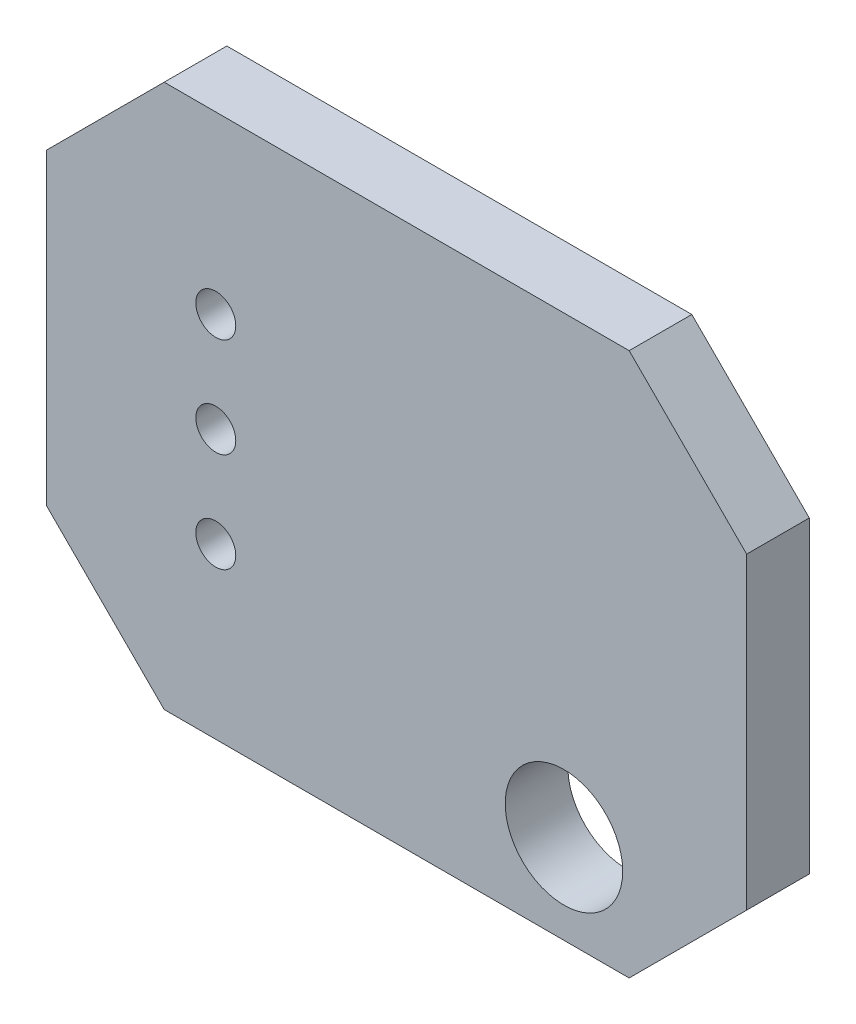
ISO-10303-21;
HEADER;
FILE_DESCRIPTION(('STEP AP214'),'2;1');
FILE_NAME('part.step','',(''),(''),'','','');
FILE_SCHEMA(('AUTOMOTIVE_DESIGN { 1 0 10303 214 1 1 1 1 }'));
ENDSEC;
DATA;
#1=APPLICATION_CONTEXT('core data for automotive mechanical design processes');
#2=APPLICATION_PROTOCOL_DEFINITION('international standard','automotive_design',2000,#1);
#3=PRODUCT_CONTEXT('',#1,'mechanical');
#4=PRODUCT('Part','Part','',(#3));
#5=PRODUCT_RELATED_PRODUCT_CATEGORY('part','',(#4));
#6=PRODUCT_DEFINITION_FORMATION('','',#4);
#7=PRODUCT_DEFINITION_CONTEXT('part definition',#1,'design');
#8=PRODUCT_DEFINITION('design','',#6,#7);
#9=PRODUCT_DEFINITION_SHAPE('','',#8);
#10=(LENGTH_UNIT() NAMED_UNIT(*) SI_UNIT(.MILLI.,.METRE.));
#11=(NAMED_UNIT(*) PLANE_ANGLE_UNIT() SI_UNIT($,.RADIAN.));
#12=(NAMED_UNIT(*) SI_UNIT($,.STERADIAN.) SOLID_ANGLE_UNIT());
#13=UNCERTAINTY_MEASURE_WITH_UNIT(LENGTH_MEASURE(1.E-05),#10,'distance_accuracy_value','');
#14=(GEOMETRIC_REPRESENTATION_CONTEXT(3) GLOBAL_UNCERTAINTY_ASSIGNED_CONTEXT((#13)) GLOBAL_UNIT_ASSIGNED_CONTEXT((#10,
#11,#12)) REPRESENTATION_CONTEXT('',''));
#15=CARTESIAN_POINT('',(0.,0.,0.));
#16=DIRECTION('',(0.,0.,1.));
#17=DIRECTION('',(1.,0.,0.));
#18=AXIS2_PLACEMENT_3D('',#15,#16,#17);
#19=CARTESIAN_POINT('',(-0.508,-1.778,1.6));
#20=DIRECTION('',(0.,1.,0.));
#21=DIRECTION('',(0.,0.,1.));
#22=AXIS2_PLACEMENT_3D('',#19,#20,#21);
#23=PLANE('',#22);
#24=DIRECTION('',(1.,0.,0.));
#25=VECTOR('',#24,1.);
#26=CARTESIAN_POINT('',(-0.508,-1.778,1.6));
#27=LINE('',#26,#25);
#28=CARTESIAN_POINT('',(2.492,-1.778,1.6));
#29=VERTEX_POINT('',#28);
#30=CARTESIAN_POINT('',(14.365,-1.778,1.6));
#31=VERTEX_POINT('',#30);
#32=EDGE_CURVE('E128',#29,#31,#27,.T.);
#33=ORIENTED_EDGE('',*,*,#32,.F.);
#34=DIRECTION('',(0.,0.,-1.));
#35=VECTOR('',#34,1.);
#36=CARTESIAN_POINT('',(2.492,-1.778,1.6));
#37=LINE('',#36,#35);
#38=CARTESIAN_POINT('',(2.492,-1.778,0.));
#39=VERTEX_POINT('',#38);
#40=EDGE_CURVE('E154',#29,#39,#37,.T.);
#41=ORIENTED_EDGE('',*,*,#40,.T.);
#42=DIRECTION('',(1.,0.,0.));
#43=VECTOR('',#42,1.);
#44=CARTESIAN_POINT('',(-0.508,-1.778,0.));
#45=LINE('',#44,#43);
#46=CARTESIAN_POINT('',(14.365,-1.778,0.));
#47=VERTEX_POINT('',#46);
#48=EDGE_CURVE('E160',#39,#47,#45,.T.);
#49=ORIENTED_EDGE('',*,*,#48,.T.);
#50=DIRECTION('',(0.,0.,1.));
#51=VECTOR('',#50,1.);
#52=CARTESIAN_POINT('',(14.365,-1.778,1.6));
#53=LINE('',#52,#51);
#54=EDGE_CURVE('E152',#47,#31,#53,.T.);
#55=ORIENTED_EDGE('',*,*,#54,.T.);
#56=EDGE_LOOP('',(#33,#41,#49,#55));
#57=FACE_BOUND('',#56,.T.);
#58=ADVANCED_FACE('F35',(#57),#23,.F.);
#59=CARTESIAN_POINT('',(17.365,-1.778,1.6));
#60=DIRECTION('',(-1.,0.,0.));
#61=DIRECTION('',(0.,0.,1.));
#62=AXIS2_PLACEMENT_3D('',#59,#60,#61);
#63=PLANE('',#62);
#64=DIRECTION('',(0.,1.,0.));
#65=VECTOR('',#64,1.);
#66=CARTESIAN_POINT('',(17.365,-1.778,1.6));
#67=LINE('',#66,#65);
#68=CARTESIAN_POINT('',(17.365,1.222,1.6));
#69=VERTEX_POINT('',#68);
#70=CARTESIAN_POINT('',(17.365,9.09499999999999,1.6));
#71=VERTEX_POINT('',#70);
#72=EDGE_CURVE('E131',#69,#71,#67,.T.);
#73=ORIENTED_EDGE('',*,*,#72,.F.);
#74=DIRECTION('',(0.,0.,-1.));
#75=VECTOR('',#74,1.);
#76=CARTESIAN_POINT('',(17.365,1.222,1.6));
#77=LINE('',#76,#75);
#78=CARTESIAN_POINT('',(17.365,1.222,0.));
#79=VERTEX_POINT('',#78);
#80=EDGE_CURVE('E11',#69,#79,#77,.T.);
#81=ORIENTED_EDGE('',*,*,#80,.T.);
#82=DIRECTION('',(0.,1.,0.));
#83=VECTOR('',#82,1.);
#84=CARTESIAN_POINT('',(17.365,-1.778,0.));
#85=LINE('',#84,#83);
#86=CARTESIAN_POINT('',(17.365,9.09499999999999,0.));
#87=VERTEX_POINT('',#86);
#88=EDGE_CURVE('E133',#79,#87,#85,.T.);
#89=ORIENTED_EDGE('',*,*,#88,.T.);
#90=DIRECTION('',(0.,0.,1.));
#91=VECTOR('',#90,1.);
#92=CARTESIAN_POINT('',(17.365,9.09499999999999,1.6));
#93=LINE('',#92,#91);
#94=EDGE_CURVE('E44',#87,#71,#93,.T.);
#95=ORIENTED_EDGE('',*,*,#94,.T.);
#96=EDGE_LOOP('',(#73,#81,#89,#95));
#97=FACE_BOUND('',#96,.T.);
#98=ADVANCED_FACE('F215',(#97),#63,.F.);
#99=CARTESIAN_POINT('',(17.365,12.095,1.6));
#100=DIRECTION('',(0.,-1.,0.));
#101=DIRECTION('',(0.,0.,-1.));
#102=AXIS2_PLACEMENT_3D('',#99,#100,#101);
#103=PLANE('',#102);
#104=DIRECTION('',(-1.,0.,0.));
#105=VECTOR('',#104,1.);
#106=CARTESIAN_POINT('',(17.365,12.095,0.));
#107=LINE('',#106,#105);
#108=CARTESIAN_POINT('',(14.365,12.095,0.));
#109=VERTEX_POINT('',#108);
#110=CARTESIAN_POINT('',(2.49200000000001,12.095,0.));
#111=VERTEX_POINT('',#110);
#112=EDGE_CURVE('E129',#109,#111,#107,.T.);
#113=ORIENTED_EDGE('',*,*,#112,.T.);
#114=DIRECTION('',(0.,0.,1.));
#115=VECTOR('',#114,1.);
#116=CARTESIAN_POINT('',(2.49200000000001,12.095,1.6));
#117=LINE('',#116,#115);
#118=CARTESIAN_POINT('',(2.49200000000001,12.095,1.6));
#119=VERTEX_POINT('',#118);
#120=EDGE_CURVE('E107',#111,#119,#117,.T.);
#121=ORIENTED_EDGE('',*,*,#120,.T.);
#122=DIRECTION('',(-1.,0.,0.));
#123=VECTOR('',#122,1.);
#124=CARTESIAN_POINT('',(17.365,12.095,1.6));
#125=LINE('',#124,#123);
#126=CARTESIAN_POINT('',(14.365,12.095,1.6));
#127=VERTEX_POINT('',#126);
#128=EDGE_CURVE('E172',#127,#119,#125,.T.);
#129=ORIENTED_EDGE('',*,*,#128,.F.);
#130=DIRECTION('',(0.,0.,-1.));
#131=VECTOR('',#130,1.);
#132=CARTESIAN_POINT('',(14.365,12.095,1.6));
#133=LINE('',#132,#131);
#134=EDGE_CURVE('E112',#127,#109,#133,.T.);
#135=ORIENTED_EDGE('',*,*,#134,.T.);
#136=EDGE_LOOP('',(#113,#121,#129,#135));
#137=FACE_BOUND('',#136,.T.);
#138=ADVANCED_FACE('F213',(#137),#103,.F.);
#139=CARTESIAN_POINT('',(-0.508,12.095,1.6));
#140=DIRECTION('',(1.,0.,0.));
#141=DIRECTION('',(0.,0.,-1.));
#142=AXIS2_PLACEMENT_3D('',#139,#140,#141);
#143=PLANE('',#142);
#144=DIRECTION('',(0.,-1.,0.));
#145=VECTOR('',#144,1.);
#146=CARTESIAN_POINT('',(-0.508,12.095,1.6));
#147=LINE('',#146,#145);
#148=CARTESIAN_POINT('',(-0.508,9.095,1.6));
#149=VERTEX_POINT('',#148);
#150=CARTESIAN_POINT('',(-0.508,1.22200000000001,1.6));
#151=VERTEX_POINT('',#150);
#152=EDGE_CURVE('E122',#149,#151,#147,.T.);
#153=ORIENTED_EDGE('',*,*,#152,.F.);
#154=DIRECTION('',(0.,0.,-1.));
#155=VECTOR('',#154,1.);
#156=CARTESIAN_POINT('',(-0.508,9.095,1.6));
#157=LINE('',#156,#155);
#158=CARTESIAN_POINT('',(-0.508,9.095,0.));
#159=VERTEX_POINT('',#158);
#160=EDGE_CURVE('E106',#149,#159,#157,.T.);
#161=ORIENTED_EDGE('',*,*,#160,.T.);
#162=DIRECTION('',(0.,-1.,0.));
#163=VECTOR('',#162,1.);
#164=CARTESIAN_POINT('',(-0.508,12.095,0.));
#165=LINE('',#164,#163);
#166=CARTESIAN_POINT('',(-0.508,1.22200000000001,0.));
#167=VERTEX_POINT('',#166);
#168=EDGE_CURVE('E119',#159,#167,#165,.T.);
#169=ORIENTED_EDGE('',*,*,#168,.T.);
#170=DIRECTION('',(0.,0.,1.));
#171=VECTOR('',#170,1.);
#172=CARTESIAN_POINT('',(-0.508,1.22200000000001,1.6));
#173=LINE('',#172,#171);
#174=EDGE_CURVE('E124',#167,#151,#173,.T.);
#175=ORIENTED_EDGE('',*,*,#174,.T.);
#176=EDGE_LOOP('',(#153,#161,#169,#175));
#177=FACE_BOUND('',#176,.T.);
#178=ADVANCED_FACE('F118',(#177),#143,.F.);
#179=CARTESIAN_POINT('',(0.,0.,1.6));
#180=DIRECTION('',(0.,0.,1.));
#181=DIRECTION('',(1.,0.,0.));
#182=AXIS2_PLACEMENT_3D('',#179,#180,#181);
#183=PLANE('',#182);
#184=CARTESIAN_POINT('',(3.81,2.54,1.6));
#185=DIRECTION('',(0.,0.,1.));
#186=DIRECTION('',(1.,0.,0.));
#187=AXIS2_PLACEMENT_3D('',#184,#185,#186);
#188=CIRCLE('',#187,0.51);
#189=CARTESIAN_POINT('',(4.32,2.54,1.6));
#190=VERTEX_POINT('',#189);
#191=EDGE_CURVE('E177',#190,#190,#188,.T.);
#192=ORIENTED_EDGE('',*,*,#191,.F.);
#193=EDGE_LOOP('',(#192));
#194=FACE_BOUND('',#193,.T.);
#195=CARTESIAN_POINT('',(3.81,5.08,1.6));
#196=DIRECTION('',(0.,0.,1.));
#197=DIRECTION('',(1.,0.,0.));
#198=AXIS2_PLACEMENT_3D('',#195,#196,#197);
#199=CIRCLE('',#198,0.51);
#200=CARTESIAN_POINT('',(4.32,5.08,1.6));
#201=VERTEX_POINT('',#200);
#202=EDGE_CURVE('E188',#201,#201,#199,.T.);
#203=ORIENTED_EDGE('',*,*,#202,.F.);
#204=EDGE_LOOP('',(#203));
#205=FACE_BOUND('',#204,.T.);
#206=CARTESIAN_POINT('',(3.81,7.62,1.6));
#207=DIRECTION('',(0.,0.,1.));
#208=DIRECTION('',(1.,0.,0.));
#209=AXIS2_PLACEMENT_3D('',#206,#207,#208);
#210=CIRCLE('',#209,0.51);
#211=CARTESIAN_POINT('',(4.32,7.62,1.6));
#212=VERTEX_POINT('',#211);
#213=EDGE_CURVE('E182',#212,#212,#210,.T.);
#214=ORIENTED_EDGE('',*,*,#213,.F.);
#215=EDGE_LOOP('',(#214));
#216=FACE_BOUND('',#215,.T.);
#217=CARTESIAN_POINT('',(12.7,0.5,1.6));
#218=DIRECTION('',(0.,0.,1.));
#219=DIRECTION('',(1.,0.,0.));
#220=AXIS2_PLACEMENT_3D('',#217,#218,#219);
#221=CIRCLE('',#220,1.5);
#222=CARTESIAN_POINT('',(14.2,0.5,1.6));
#223=VERTEX_POINT('',#222);
#224=EDGE_CURVE('E165',#223,#223,#221,.T.);
#225=ORIENTED_EDGE('',*,*,#224,.F.);
#226=EDGE_LOOP('',(#225));
#227=FACE_BOUND('',#226,.T.);
#228=ORIENTED_EDGE('',*,*,#128,.T.);
#229=DIRECTION('',(0.707106781186549,0.707106781186546,0.));
#230=VECTOR('',#229,1.);
#231=CARTESIAN_POINT('',(-4.8015,4.80150000000001,1.6));
#232=LINE('',#231,#230);
#233=EDGE_CURVE('E150',#119,#149,#232,.F.);
#234=ORIENTED_EDGE('',*,*,#233,.T.);
#235=ORIENTED_EDGE('',*,*,#152,.T.);
#236=DIRECTION('',(-0.707106781186546,0.707106781186549,0.));
#237=VECTOR('',#236,1.);
#238=CARTESIAN_POINT('',(0.357000000000004,0.357000000000003,1.6));
#239=LINE('',#238,#237);
#240=EDGE_CURVE('E148',#151,#29,#239,.F.);
#241=ORIENTED_EDGE('',*,*,#240,.T.);
#242=ORIENTED_EDGE('',*,*,#32,.T.);
#243=DIRECTION('',(-0.707106781186549,-0.707106781186546,0.));
#244=VECTOR('',#243,1.);
#245=CARTESIAN_POINT('',(8.07149999999997,-8.0715,1.6));
#246=LINE('',#245,#244);
#247=EDGE_CURVE('E57',#31,#69,#246,.F.);
#248=ORIENTED_EDGE('',*,*,#247,.T.);
#249=ORIENTED_EDGE('',*,*,#72,.T.);
#250=DIRECTION('',(0.707106781186546,-0.707106781186549,0.));
#251=VECTOR('',#250,1.);
#252=CARTESIAN_POINT('',(13.23,13.23,1.6));
#253=LINE('',#252,#251);
#254=EDGE_CURVE('E145',#71,#127,#253,.F.);
#255=ORIENTED_EDGE('',*,*,#254,.T.);
#256=EDGE_LOOP('',(#228,#234,#235,#241,#242,#248,#249,#255));
#257=FACE_BOUND('',#256,.T.);
#258=ADVANCED_FACE('F200',(#194,#205,#216,#227,#257),#183,.T.);
#259=CARTESIAN_POINT('',(0.,0.,0.));
#260=DIRECTION('',(0.,0.,1.));
#261=DIRECTION('',(1.,0.,0.));
#262=AXIS2_PLACEMENT_3D('',#259,#260,#261);
#263=PLANE('',#262);
#264=CARTESIAN_POINT('',(3.81,2.54,0.));
#265=DIRECTION('',(0.,0.,1.));
#266=DIRECTION('',(1.,0.,0.));
#267=AXIS2_PLACEMENT_3D('',#264,#265,#266);
#268=CIRCLE('',#267,0.51);
#269=CARTESIAN_POINT('',(4.32,2.54,0.));
#270=VERTEX_POINT('',#269);
#271=EDGE_CURVE('E191',#270,#270,#268,.T.);
#272=ORIENTED_EDGE('',*,*,#271,.T.);
#273=EDGE_LOOP('',(#272));
#274=FACE_BOUND('',#273,.T.);
#275=CARTESIAN_POINT('',(3.81,5.08,0.));
#276=DIRECTION('',(0.,0.,1.));
#277=DIRECTION('',(1.,0.,0.));
#278=AXIS2_PLACEMENT_3D('',#275,#276,#277);
#279=CIRCLE('',#278,0.51);
#280=CARTESIAN_POINT('',(4.32,5.08,0.));
#281=VERTEX_POINT('',#280);
#282=EDGE_CURVE('E185',#281,#281,#279,.T.);
#283=ORIENTED_EDGE('',*,*,#282,.T.);
#284=EDGE_LOOP('',(#283));
#285=FACE_BOUND('',#284,.T.);
#286=CARTESIAN_POINT('',(3.81,7.62,0.));
#287=DIRECTION('',(0.,0.,1.));
#288=DIRECTION('',(1.,0.,0.));
#289=AXIS2_PLACEMENT_3D('',#286,#287,#288);
#290=CIRCLE('',#289,0.51);
#291=CARTESIAN_POINT('',(4.32,7.62,0.));
#292=VERTEX_POINT('',#291);
#293=EDGE_CURVE('E179',#292,#292,#290,.T.);
#294=ORIENTED_EDGE('',*,*,#293,.T.);
#295=EDGE_LOOP('',(#294));
#296=FACE_BOUND('',#295,.T.);
#297=CARTESIAN_POINT('',(12.7,0.5,0.));
#298=DIRECTION('',(0.,0.,1.));
#299=DIRECTION('',(1.,0.,0.));
#300=AXIS2_PLACEMENT_3D('',#297,#298,#299);
#301=CIRCLE('',#300,1.5);
#302=CARTESIAN_POINT('',(14.2,0.5,0.));
#303=VERTEX_POINT('',#302);
#304=EDGE_CURVE('E168',#303,#303,#301,.T.);
#305=ORIENTED_EDGE('',*,*,#304,.T.);
#306=EDGE_LOOP('',(#305));
#307=FACE_BOUND('',#306,.T.);
#308=ORIENTED_EDGE('',*,*,#168,.F.);
#309=DIRECTION('',(-0.707106781186549,-0.707106781186546,0.));
#310=VECTOR('',#309,1.);
#311=CARTESIAN_POINT('',(-0.508,9.095,0.));
#312=LINE('',#311,#310);
#313=EDGE_CURVE('E102',#159,#111,#312,.F.);
#314=ORIENTED_EDGE('',*,*,#313,.T.);
#315=ORIENTED_EDGE('',*,*,#112,.F.);
#316=DIRECTION('',(-0.707106781186546,0.707106781186549,0.));
#317=VECTOR('',#316,1.);
#318=CARTESIAN_POINT('',(14.365,12.095,0.));
#319=LINE('',#318,#317);
#320=EDGE_CURVE('E123',#109,#87,#319,.F.);
#321=ORIENTED_EDGE('',*,*,#320,.T.);
#322=ORIENTED_EDGE('',*,*,#88,.F.);
#323=DIRECTION('',(0.707106781186549,0.707106781186546,0.));
#324=VECTOR('',#323,1.);
#325=CARTESIAN_POINT('',(17.365,1.222,0.));
#326=LINE('',#325,#324);
#327=EDGE_CURVE('E139',#79,#47,#326,.F.);
#328=ORIENTED_EDGE('',*,*,#327,.T.);
#329=ORIENTED_EDGE('',*,*,#48,.F.);
#330=DIRECTION('',(0.707106781186546,-0.707106781186549,0.));
#331=VECTOR('',#330,1.);
#332=CARTESIAN_POINT('',(2.492,-1.778,0.));
#333=LINE('',#332,#331);
#334=EDGE_CURVE('E113',#39,#167,#333,.F.);
#335=ORIENTED_EDGE('',*,*,#334,.T.);
#336=EDGE_LOOP('',(#308,#314,#315,#321,#322,#328,#329,#335));
#337=FACE_BOUND('',#336,.T.);
#338=ADVANCED_FACE('F126',(#274,#285,#296,#307,#337),#263,.F.);
#339=CARTESIAN_POINT('',(12.7,0.5,1.6));
#340=DIRECTION('',(0.,0.,-1.));
#341=DIRECTION('',(-1.,0.,0.));
#342=AXIS2_PLACEMENT_3D('',#339,#340,#341);
#343=CYLINDRICAL_SURFACE('',#342,1.5);
#344=ORIENTED_EDGE('',*,*,#224,.T.);
#345=EDGE_LOOP('',(#344));
#346=FACE_BOUND('',#345,.T.);
#347=ORIENTED_EDGE('',*,*,#304,.F.);
#348=EDGE_LOOP('',(#347));
#349=FACE_BOUND('',#348,.T.);
#350=ADVANCED_FACE('F251',(#346,#349),#343,.F.);
#351=CARTESIAN_POINT('',(3.81,7.62,1.6));
#352=DIRECTION('',(0.,0.,-1.));
#353=DIRECTION('',(-1.,0.,0.));
#354=AXIS2_PLACEMENT_3D('',#351,#352,#353);
#355=CYLINDRICAL_SURFACE('',#354,0.51);
#356=ORIENTED_EDGE('',*,*,#213,.T.);
#357=EDGE_LOOP('',(#356));
#358=FACE_BOUND('',#357,.T.);
#359=ORIENTED_EDGE('',*,*,#293,.F.);
#360=EDGE_LOOP('',(#359));
#361=FACE_BOUND('',#360,.T.);
#362=ADVANCED_FACE('F256',(#358,#361),#355,.F.);
#363=CARTESIAN_POINT('',(3.81,5.08,1.6));
#364=DIRECTION('',(0.,0.,-1.));
#365=DIRECTION('',(-1.,0.,0.));
#366=AXIS2_PLACEMENT_3D('',#363,#364,#365);
#367=CYLINDRICAL_SURFACE('',#366,0.51);
#368=ORIENTED_EDGE('',*,*,#202,.T.);
#369=EDGE_LOOP('',(#368));
#370=FACE_BOUND('',#369,.T.);
#371=ORIENTED_EDGE('',*,*,#282,.F.);
#372=EDGE_LOOP('',(#371));
#373=FACE_BOUND('',#372,.T.);
#374=ADVANCED_FACE('F260',(#370,#373),#367,.F.);
#375=CARTESIAN_POINT('',(3.81,2.54,1.6));
#376=DIRECTION('',(0.,0.,-1.));
#377=DIRECTION('',(-1.,0.,0.));
#378=AXIS2_PLACEMENT_3D('',#375,#376,#377);
#379=CYLINDRICAL_SURFACE('',#378,0.51);
#380=ORIENTED_EDGE('',*,*,#191,.T.);
#381=EDGE_LOOP('',(#380));
#382=FACE_BOUND('',#381,.T.);
#383=ORIENTED_EDGE('',*,*,#271,.F.);
#384=EDGE_LOOP('',(#383));
#385=FACE_BOUND('',#384,.T.);
#386=ADVANCED_FACE('F197',(#382,#385),#379,.F.);
#387=CARTESIAN_POINT('',(-0.508,9.095,1.6));
#388=DIRECTION('',(0.707106781186546,-0.707106781186549,0.));
#389=DIRECTION('',(0.,0.,-1.));
#390=AXIS2_PLACEMENT_3D('',#387,#388,#389);
#391=PLANE('',#390);
#392=ORIENTED_EDGE('',*,*,#233,.F.);
#393=ORIENTED_EDGE('',*,*,#120,.F.);
#394=ORIENTED_EDGE('',*,*,#313,.F.);
#395=ORIENTED_EDGE('',*,*,#160,.F.);
#396=EDGE_LOOP('',(#392,#393,#394,#395));
#397=FACE_BOUND('',#396,.T.);
#398=ADVANCED_FACE('F105',(#397),#391,.F.);
#399=CARTESIAN_POINT('',(2.492,-1.778,1.6));
#400=DIRECTION('',(0.707106781186549,0.707106781186546,0.));
#401=DIRECTION('',(0.,0.,-1.));
#402=AXIS2_PLACEMENT_3D('',#399,#400,#401);
#403=PLANE('',#402);
#404=ORIENTED_EDGE('',*,*,#240,.F.);
#405=ORIENTED_EDGE('',*,*,#174,.F.);
#406=ORIENTED_EDGE('',*,*,#334,.F.);
#407=ORIENTED_EDGE('',*,*,#40,.F.);
#408=EDGE_LOOP('',(#404,#405,#406,#407));
#409=FACE_BOUND('',#408,.T.);
#410=ADVANCED_FACE('F219',(#409),#403,.F.);
#411=CARTESIAN_POINT('',(17.365,1.222,1.6));
#412=DIRECTION('',(-0.707106781186546,0.707106781186549,0.));
#413=DIRECTION('',(0.,0.,-1.));
#414=AXIS2_PLACEMENT_3D('',#411,#412,#413);
#415=PLANE('',#414);
#416=ORIENTED_EDGE('',*,*,#247,.F.);
#417=ORIENTED_EDGE('',*,*,#54,.F.);
#418=ORIENTED_EDGE('',*,*,#327,.F.);
#419=ORIENTED_EDGE('',*,*,#80,.F.);
#420=EDGE_LOOP('',(#416,#417,#418,#419));
#421=FACE_BOUND('',#420,.T.);
#422=ADVANCED_FACE('F218',(#421),#415,.F.);
#423=CARTESIAN_POINT('',(14.365,12.095,1.6));
#424=DIRECTION('',(-0.707106781186549,-0.707106781186546,0.));
#425=DIRECTION('',(0.,0.,-1.));
#426=AXIS2_PLACEMENT_3D('',#423,#424,#425);
#427=PLANE('',#426);
#428=ORIENTED_EDGE('',*,*,#254,.F.);
#429=ORIENTED_EDGE('',*,*,#94,.F.);
#430=ORIENTED_EDGE('',*,*,#320,.F.);
#431=ORIENTED_EDGE('',*,*,#134,.F.);
#432=EDGE_LOOP('',(#428,#429,#430,#431));
#433=FACE_BOUND('',#432,.T.);
#434=ADVANCED_FACE('F38',(#433),#427,.F.);
#435=CLOSED_SHELL('',(#58,#98,#138,#178,#258,#338,#350,#362,#374,#386,#398,#410,#422,#434));
#436=MANIFOLD_SOLID_BREP('B2',#435);
#437=ADVANCED_BREP_SHAPE_REPRESENTATION('',(#18,#436),#14);
#438=SHAPE_DEFINITION_REPRESENTATION(#9,#437);
ENDSEC;
END-ISO-10303-21;
